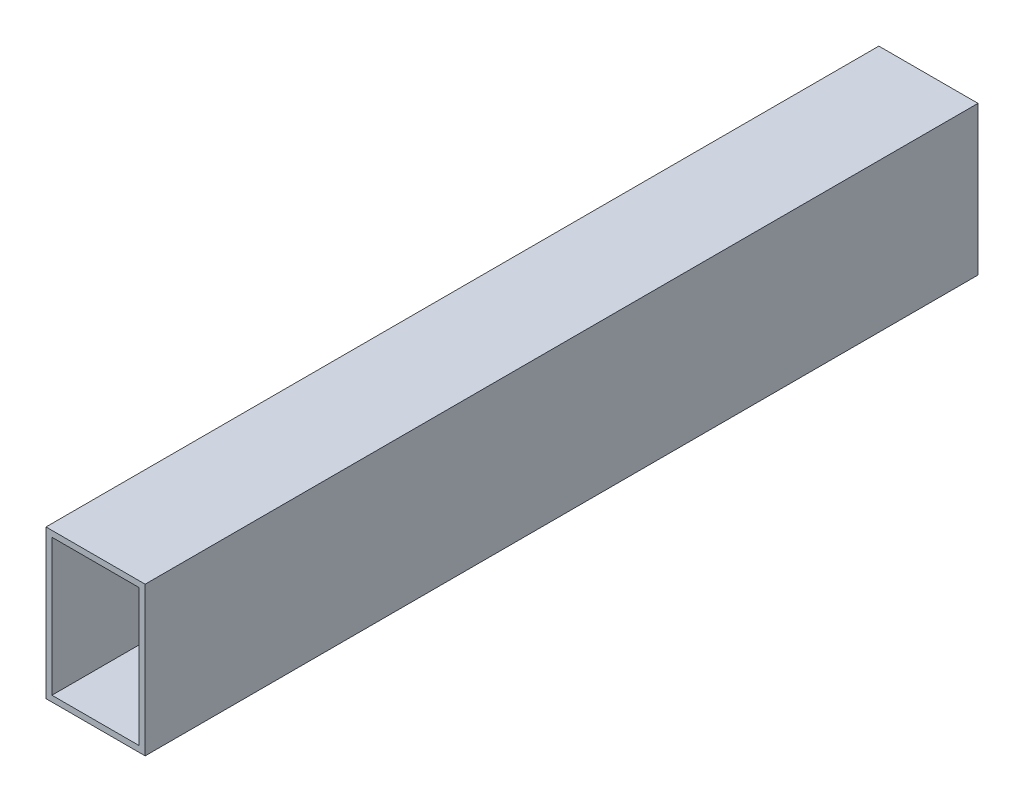
ISO-10303-21;
HEADER;
FILE_DESCRIPTION(('STEP AP214'),'2;1');
FILE_NAME('part.step','',(''),(''),'','','');
FILE_SCHEMA(('AUTOMOTIVE_DESIGN { 1 0 10303 214 1 1 1 1 }'));
ENDSEC;
DATA;
#1=APPLICATION_CONTEXT('core data for automotive mechanical design processes');
#2=APPLICATION_PROTOCOL_DEFINITION('international standard','automotive_design',2000,#1);
#3=PRODUCT_CONTEXT('',#1,'mechanical');
#4=PRODUCT('Part','Part','',(#3));
#5=PRODUCT_RELATED_PRODUCT_CATEGORY('part','',(#4));
#6=PRODUCT_DEFINITION_FORMATION('','',#4);
#7=PRODUCT_DEFINITION_CONTEXT('part definition',#1,'design');
#8=PRODUCT_DEFINITION('design','',#6,#7);
#9=PRODUCT_DEFINITION_SHAPE('','',#8);
#10=(LENGTH_UNIT() NAMED_UNIT(*) SI_UNIT(.MILLI.,.METRE.));
#11=(NAMED_UNIT(*) PLANE_ANGLE_UNIT() SI_UNIT($,.RADIAN.));
#12=(NAMED_UNIT(*) SI_UNIT($,.STERADIAN.) SOLID_ANGLE_UNIT());
#13=UNCERTAINTY_MEASURE_WITH_UNIT(LENGTH_MEASURE(1.E-05),#10,'distance_accuracy_value','');
#14=(GEOMETRIC_REPRESENTATION_CONTEXT(3) GLOBAL_UNCERTAINTY_ASSIGNED_CONTEXT((#13)) GLOBAL_UNIT_ASSIGNED_CONTEXT((#10,
#11,#12)) REPRESENTATION_CONTEXT('',''));
#15=CARTESIAN_POINT('',(0.,0.,0.));
#16=DIRECTION('',(0.,0.,1.));
#17=DIRECTION('',(1.,0.,0.));
#18=AXIS2_PLACEMENT_3D('',#15,#16,#17);
#19=CARTESIAN_POINT('',(0.,0.,420.));
#20=DIRECTION('',(0.,0.,-1.));
#21=DIRECTION('',(-1.,0.,0.));
#22=AXIS2_PLACEMENT_3D('',#19,#20,#21);
#23=PLANE('',#22);
#24=DIRECTION('',(0.,-1.,0.));
#25=VECTOR('',#24,1.);
#26=CARTESIAN_POINT('',(-50.,-75.,420.));
#27=LINE('',#26,#25);
#28=CARTESIAN_POINT('',(-50.,74.9999999999999,420.));
#29=VERTEX_POINT('',#28);
#30=CARTESIAN_POINT('',(-50.,-75.,420.));
#31=VERTEX_POINT('',#30);
#32=EDGE_CURVE('E134',#29,#31,#27,.T.);
#33=ORIENTED_EDGE('',*,*,#32,.T.);
#34=DIRECTION('',(1.,0.,0.));
#35=VECTOR('',#34,1.);
#36=CARTESIAN_POINT('',(-50.,-75.,420.));
#37=LINE('',#36,#35);
#38=CARTESIAN_POINT('',(50.,-75.,420.));
#39=VERTEX_POINT('',#38);
#40=EDGE_CURVE('E137',#31,#39,#37,.T.);
#41=ORIENTED_EDGE('',*,*,#40,.T.);
#42=DIRECTION('',(0.,1.,0.));
#43=VECTOR('',#42,1.);
#44=CARTESIAN_POINT('',(50.,-75.,420.));
#45=LINE('',#44,#43);
#46=CARTESIAN_POINT('',(50.,75.,420.));
#47=VERTEX_POINT('',#46);
#48=EDGE_CURVE('E140',#39,#47,#45,.T.);
#49=ORIENTED_EDGE('',*,*,#48,.T.);
#50=DIRECTION('',(-1.,0.,0.));
#51=VECTOR('',#50,1.);
#52=CARTESIAN_POINT('',(-50.,74.9999999999999,420.));
#53=LINE('',#52,#51);
#54=EDGE_CURVE('E142',#47,#29,#53,.T.);
#55=ORIENTED_EDGE('',*,*,#54,.T.);
#56=EDGE_LOOP('',(#33,#41,#49,#55));
#57=FACE_BOUND('',#56,.T.);
#58=DIRECTION('',(0.,-1.,0.));
#59=VECTOR('',#58,1.);
#60=CARTESIAN_POINT('',(-44.,-69.,420.));
#61=LINE('',#60,#59);
#62=CARTESIAN_POINT('',(-44.,69.,420.));
#63=VERTEX_POINT('',#62);
#64=CARTESIAN_POINT('',(-44.,-69.,420.));
#65=VERTEX_POINT('',#64);
#66=EDGE_CURVE('E98',#63,#65,#61,.T.);
#67=ORIENTED_EDGE('',*,*,#66,.F.);
#68=DIRECTION('',(-1.,0.,0.));
#69=VECTOR('',#68,1.);
#70=CARTESIAN_POINT('',(-44.,69.,420.));
#71=LINE('',#70,#69);
#72=CARTESIAN_POINT('',(44.,69.,420.));
#73=VERTEX_POINT('',#72);
#74=EDGE_CURVE('E120',#73,#63,#71,.T.);
#75=ORIENTED_EDGE('',*,*,#74,.F.);
#76=DIRECTION('',(0.,1.,0.));
#77=VECTOR('',#76,1.);
#78=CARTESIAN_POINT('',(44.,-69.,420.));
#79=LINE('',#78,#77);
#80=CARTESIAN_POINT('',(44.,-69.,420.));
#81=VERTEX_POINT('',#80);
#82=EDGE_CURVE('E118',#81,#73,#79,.T.);
#83=ORIENTED_EDGE('',*,*,#82,.F.);
#84=DIRECTION('',(1.,0.,0.));
#85=VECTOR('',#84,1.);
#86=CARTESIAN_POINT('',(-44.,-69.,420.));
#87=LINE('',#86,#85);
#88=EDGE_CURVE('E106',#65,#81,#87,.T.);
#89=ORIENTED_EDGE('',*,*,#88,.F.);
#90=EDGE_LOOP('',(#67,#75,#83,#89));
#91=FACE_BOUND('',#90,.T.);
#92=ADVANCED_FACE('F33',(#57,#91),#23,.F.);
#93=CARTESIAN_POINT('',(0.,0.,-420.));
#94=DIRECTION('',(0.,0.,-1.));
#95=DIRECTION('',(-1.,0.,0.));
#96=AXIS2_PLACEMENT_3D('',#93,#94,#95);
#97=PLANE('',#96);
#98=DIRECTION('',(0.,-1.,0.));
#99=VECTOR('',#98,1.);
#100=CARTESIAN_POINT('',(-50.,-75.,-420.));
#101=LINE('',#100,#99);
#102=CARTESIAN_POINT('',(-50.,74.9999999999999,-420.));
#103=VERTEX_POINT('',#102);
#104=CARTESIAN_POINT('',(-50.,-75.,-420.));
#105=VERTEX_POINT('',#104);
#106=EDGE_CURVE('E114',#103,#105,#101,.T.);
#107=ORIENTED_EDGE('',*,*,#106,.F.);
#108=DIRECTION('',(-1.,0.,0.));
#109=VECTOR('',#108,1.);
#110=CARTESIAN_POINT('',(-50.,74.9999999999999,-420.));
#111=LINE('',#110,#109);
#112=CARTESIAN_POINT('',(50.,75.,-420.));
#113=VERTEX_POINT('',#112);
#114=EDGE_CURVE('E138',#113,#103,#111,.T.);
#115=ORIENTED_EDGE('',*,*,#114,.F.);
#116=DIRECTION('',(0.,1.,0.));
#117=VECTOR('',#116,1.);
#118=CARTESIAN_POINT('',(50.,-75.,-420.));
#119=LINE('',#118,#117);
#120=CARTESIAN_POINT('',(50.,-75.,-420.));
#121=VERTEX_POINT('',#120);
#122=EDGE_CURVE('E149',#121,#113,#119,.T.);
#123=ORIENTED_EDGE('',*,*,#122,.F.);
#124=DIRECTION('',(1.,0.,0.));
#125=VECTOR('',#124,1.);
#126=CARTESIAN_POINT('',(-50.,-75.,-420.));
#127=LINE('',#126,#125);
#128=EDGE_CURVE('E147',#105,#121,#127,.T.);
#129=ORIENTED_EDGE('',*,*,#128,.F.);
#130=EDGE_LOOP('',(#107,#115,#123,#129));
#131=FACE_BOUND('',#130,.T.);
#132=DIRECTION('',(-1.,0.,0.));
#133=VECTOR('',#132,1.);
#134=CARTESIAN_POINT('',(-44.,69.,-420.));
#135=LINE('',#134,#133);
#136=CARTESIAN_POINT('',(44.,69.,-420.));
#137=VERTEX_POINT('',#136);
#138=CARTESIAN_POINT('',(-44.,69.,-420.));
#139=VERTEX_POINT('',#138);
#140=EDGE_CURVE('E107',#137,#139,#135,.T.);
#141=ORIENTED_EDGE('',*,*,#140,.T.);
#142=DIRECTION('',(0.,-1.,0.));
#143=VECTOR('',#142,1.);
#144=CARTESIAN_POINT('',(-44.,-69.,-420.));
#145=LINE('',#144,#143);
#146=CARTESIAN_POINT('',(-44.,-69.,-420.));
#147=VERTEX_POINT('',#146);
#148=EDGE_CURVE('E56',#139,#147,#145,.T.);
#149=ORIENTED_EDGE('',*,*,#148,.T.);
#150=DIRECTION('',(1.,0.,0.));
#151=VECTOR('',#150,1.);
#152=CARTESIAN_POINT('',(-44.,-69.,-420.));
#153=LINE('',#152,#151);
#154=CARTESIAN_POINT('',(44.,-69.,-420.));
#155=VERTEX_POINT('',#154);
#156=EDGE_CURVE('E113',#147,#155,#153,.T.);
#157=ORIENTED_EDGE('',*,*,#156,.T.);
#158=DIRECTION('',(0.,1.,0.));
#159=VECTOR('',#158,1.);
#160=CARTESIAN_POINT('',(44.,-69.,-420.));
#161=LINE('',#160,#159);
#162=EDGE_CURVE('E126',#155,#137,#161,.T.);
#163=ORIENTED_EDGE('',*,*,#162,.T.);
#164=EDGE_LOOP('',(#141,#149,#157,#163));
#165=FACE_BOUND('',#164,.T.);
#166=ADVANCED_FACE('F167',(#131,#165),#97,.T.);
#167=CARTESIAN_POINT('',(-50.,-75.,420.));
#168=DIRECTION('',(1.,0.,0.));
#169=DIRECTION('',(0.,1.,0.));
#170=AXIS2_PLACEMENT_3D('',#167,#168,#169);
#171=PLANE('',#170);
#172=ORIENTED_EDGE('',*,*,#106,.T.);
#173=DIRECTION('',(0.,0.,-1.));
#174=VECTOR('',#173,1.);
#175=CARTESIAN_POINT('',(-50.,-75.,420.));
#176=LINE('',#175,#174);
#177=EDGE_CURVE('E11',#31,#105,#176,.T.);
#178=ORIENTED_EDGE('',*,*,#177,.F.);
#179=ORIENTED_EDGE('',*,*,#32,.F.);
#180=DIRECTION('',(0.,0.,-1.));
#181=VECTOR('',#180,1.);
#182=CARTESIAN_POINT('',(-50.,74.9999999999999,420.));
#183=LINE('',#182,#181);
#184=EDGE_CURVE('E144',#29,#103,#183,.T.);
#185=ORIENTED_EDGE('',*,*,#184,.T.);
#186=EDGE_LOOP('',(#172,#178,#179,#185));
#187=FACE_BOUND('',#186,.T.);
#188=ADVANCED_FACE('F35',(#187),#171,.F.);
#189=CARTESIAN_POINT('',(-50.,-75.,420.));
#190=DIRECTION('',(0.,1.,0.));
#191=DIRECTION('',(0.,0.,1.));
#192=AXIS2_PLACEMENT_3D('',#189,#190,#191);
#193=PLANE('',#192);
#194=ORIENTED_EDGE('',*,*,#128,.T.);
#195=DIRECTION('',(0.,0.,-1.));
#196=VECTOR('',#195,1.);
#197=CARTESIAN_POINT('',(50.,-75.,420.));
#198=LINE('',#197,#196);
#199=EDGE_CURVE('E41',#39,#121,#198,.T.);
#200=ORIENTED_EDGE('',*,*,#199,.F.);
#201=ORIENTED_EDGE('',*,*,#40,.F.);
#202=ORIENTED_EDGE('',*,*,#177,.T.);
#203=EDGE_LOOP('',(#194,#200,#201,#202));
#204=FACE_BOUND('',#203,.T.);
#205=ADVANCED_FACE('F177',(#204),#193,.F.);
#206=CARTESIAN_POINT('',(50.,-75.,420.));
#207=DIRECTION('',(-1.,0.,0.));
#208=DIRECTION('',(0.,-1.,0.));
#209=AXIS2_PLACEMENT_3D('',#206,#207,#208);
#210=PLANE('',#209);
#211=ORIENTED_EDGE('',*,*,#122,.T.);
#212=DIRECTION('',(0.,0.,-1.));
#213=VECTOR('',#212,1.);
#214=CARTESIAN_POINT('',(50.,75.,420.));
#215=LINE('',#214,#213);
#216=EDGE_CURVE('E154',#47,#113,#215,.T.);
#217=ORIENTED_EDGE('',*,*,#216,.F.);
#218=ORIENTED_EDGE('',*,*,#48,.F.);
#219=ORIENTED_EDGE('',*,*,#199,.T.);
#220=EDGE_LOOP('',(#211,#217,#218,#219));
#221=FACE_BOUND('',#220,.T.);
#222=ADVANCED_FACE('F161',(#221),#210,.F.);
#223=CARTESIAN_POINT('',(-50.,74.9999999999999,420.));
#224=DIRECTION('',(0.,-1.,0.));
#225=DIRECTION('',(1.,0.,0.));
#226=AXIS2_PLACEMENT_3D('',#223,#224,#225);
#227=PLANE('',#226);
#228=ORIENTED_EDGE('',*,*,#114,.T.);
#229=ORIENTED_EDGE('',*,*,#184,.F.);
#230=ORIENTED_EDGE('',*,*,#54,.F.);
#231=ORIENTED_EDGE('',*,*,#216,.T.);
#232=EDGE_LOOP('',(#228,#229,#230,#231));
#233=FACE_BOUND('',#232,.T.);
#234=ADVANCED_FACE('F171',(#233),#227,.F.);
#235=CARTESIAN_POINT('',(-44.,-69.,420.));
#236=DIRECTION('',(1.,0.,0.));
#237=DIRECTION('',(0.,0.,-1.));
#238=AXIS2_PLACEMENT_3D('',#235,#236,#237);
#239=PLANE('',#238);
#240=ORIENTED_EDGE('',*,*,#148,.F.);
#241=DIRECTION('',(0.,0.,-1.));
#242=VECTOR('',#241,1.);
#243=CARTESIAN_POINT('',(-44.,69.,420.));
#244=LINE('',#243,#242);
#245=EDGE_CURVE('E102',#63,#139,#244,.T.);
#246=ORIENTED_EDGE('',*,*,#245,.F.);
#247=ORIENTED_EDGE('',*,*,#66,.T.);
#248=DIRECTION('',(0.,0.,-1.));
#249=VECTOR('',#248,1.);
#250=CARTESIAN_POINT('',(-44.,-69.,420.));
#251=LINE('',#250,#249);
#252=EDGE_CURVE('E101',#65,#147,#251,.T.);
#253=ORIENTED_EDGE('',*,*,#252,.T.);
#254=EDGE_LOOP('',(#240,#246,#247,#253));
#255=FACE_BOUND('',#254,.T.);
#256=ADVANCED_FACE('F100',(#255),#239,.T.);
#257=CARTESIAN_POINT('',(-44.,-69.,420.));
#258=DIRECTION('',(0.,1.,0.));
#259=DIRECTION('',(0.,0.,1.));
#260=AXIS2_PLACEMENT_3D('',#257,#258,#259);
#261=PLANE('',#260);
#262=ORIENTED_EDGE('',*,*,#156,.F.);
#263=ORIENTED_EDGE('',*,*,#252,.F.);
#264=ORIENTED_EDGE('',*,*,#88,.T.);
#265=DIRECTION('',(0.,0.,-1.));
#266=VECTOR('',#265,1.);
#267=CARTESIAN_POINT('',(44.,-69.,420.));
#268=LINE('',#267,#266);
#269=EDGE_CURVE('E115',#81,#155,#268,.T.);
#270=ORIENTED_EDGE('',*,*,#269,.T.);
#271=EDGE_LOOP('',(#262,#263,#264,#270));
#272=FACE_BOUND('',#271,.T.);
#273=ADVANCED_FACE('F110',(#272),#261,.T.);
#274=CARTESIAN_POINT('',(44.,-69.,420.));
#275=DIRECTION('',(-1.,0.,0.));
#276=DIRECTION('',(0.,0.,1.));
#277=AXIS2_PLACEMENT_3D('',#274,#275,#276);
#278=PLANE('',#277);
#279=ORIENTED_EDGE('',*,*,#162,.F.);
#280=ORIENTED_EDGE('',*,*,#269,.F.);
#281=ORIENTED_EDGE('',*,*,#82,.T.);
#282=DIRECTION('',(0.,0.,-1.));
#283=VECTOR('',#282,1.);
#284=CARTESIAN_POINT('',(44.,69.,420.));
#285=LINE('',#284,#283);
#286=EDGE_CURVE('E48',#73,#137,#285,.T.);
#287=ORIENTED_EDGE('',*,*,#286,.T.);
#288=EDGE_LOOP('',(#279,#280,#281,#287));
#289=FACE_BOUND('',#288,.T.);
#290=ADVANCED_FACE('F200',(#289),#278,.T.);
#291=CARTESIAN_POINT('',(-44.,69.,420.));
#292=DIRECTION('',(0.,-1.,0.));
#293=DIRECTION('',(0.,0.,-1.));
#294=AXIS2_PLACEMENT_3D('',#291,#292,#293);
#295=PLANE('',#294);
#296=ORIENTED_EDGE('',*,*,#140,.F.);
#297=ORIENTED_EDGE('',*,*,#286,.F.);
#298=ORIENTED_EDGE('',*,*,#74,.T.);
#299=ORIENTED_EDGE('',*,*,#245,.T.);
#300=EDGE_LOOP('',(#296,#297,#298,#299));
#301=FACE_BOUND('',#300,.T.);
#302=ADVANCED_FACE('F204',(#301),#295,.T.);
#303=CLOSED_SHELL('',(#92,#166,#188,#205,#222,#234,#256,#273,#290,#302));
#304=MANIFOLD_SOLID_BREP('B2',#303);
#305=ADVANCED_BREP_SHAPE_REPRESENTATION('',(#18,#304),#14);
#306=SHAPE_DEFINITION_REPRESENTATION(#9,#305);
ENDSEC;
END-ISO-10303-21;
